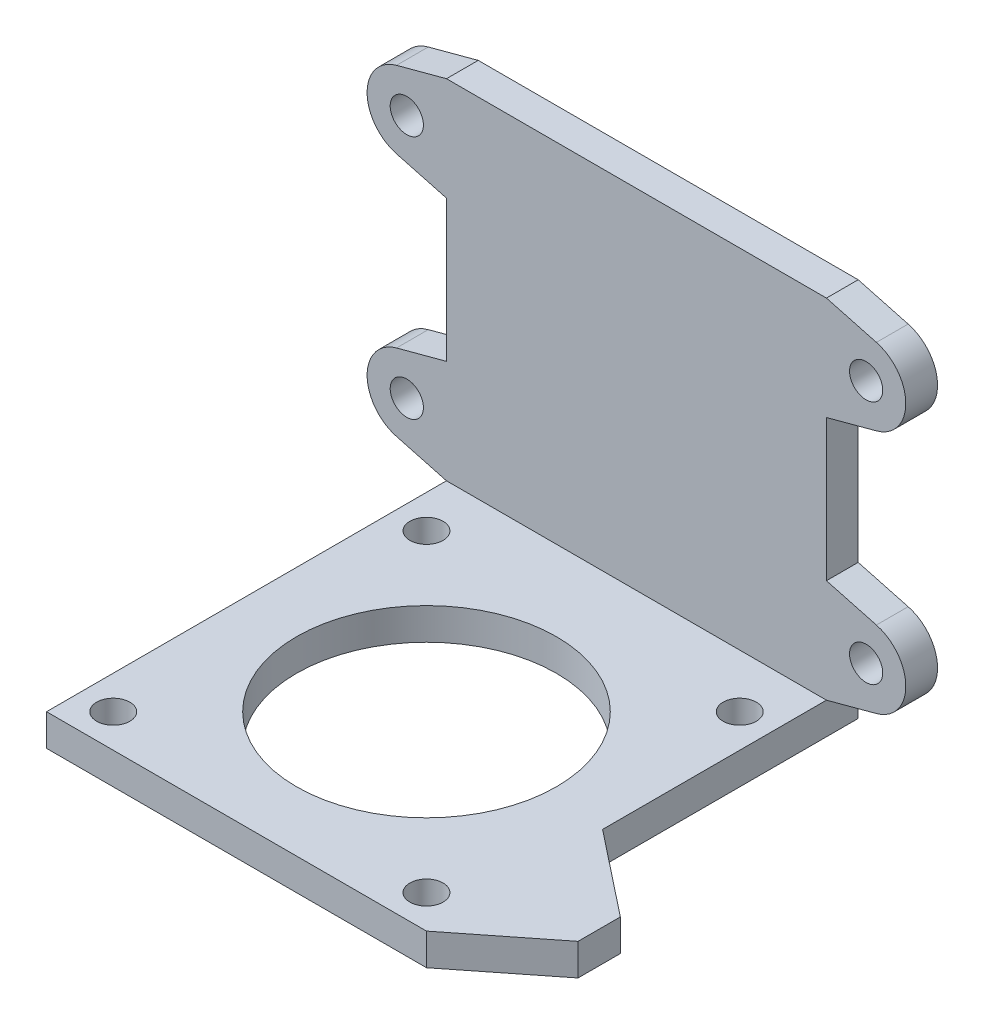
ISO-10303-21;
HEADER;
FILE_DESCRIPTION(('STEP AP214'),'2;1');
FILE_NAME('part.step','',(''),(''),'','','');
FILE_SCHEMA(('AUTOMOTIVE_DESIGN { 1 0 10303 214 1 1 1 1 }'));
ENDSEC;
DATA;
#1=APPLICATION_CONTEXT('core data for automotive mechanical design processes');
#2=APPLICATION_PROTOCOL_DEFINITION('international standard','automotive_design',2000,#1);
#3=PRODUCT_CONTEXT('',#1,'mechanical');
#4=PRODUCT('Part','Part','',(#3));
#5=PRODUCT_RELATED_PRODUCT_CATEGORY('part','',(#4));
#6=PRODUCT_DEFINITION_FORMATION('','',#4);
#7=PRODUCT_DEFINITION_CONTEXT('part definition',#1,'design');
#8=PRODUCT_DEFINITION('design','',#6,#7);
#9=PRODUCT_DEFINITION_SHAPE('','',#8);
#10=(LENGTH_UNIT() NAMED_UNIT(*) SI_UNIT(.MILLI.,.METRE.));
#11=(NAMED_UNIT(*) PLANE_ANGLE_UNIT() SI_UNIT($,.RADIAN.));
#12=(NAMED_UNIT(*) SI_UNIT($,.STERADIAN.) SOLID_ANGLE_UNIT());
#13=UNCERTAINTY_MEASURE_WITH_UNIT(LENGTH_MEASURE(1.E-05),#10,'distance_accuracy_value','');
#14=(GEOMETRIC_REPRESENTATION_CONTEXT(3) GLOBAL_UNCERTAINTY_ASSIGNED_CONTEXT((#13)) GLOBAL_UNIT_ASSIGNED_CONTEXT((#10,
#11,#12)) REPRESENTATION_CONTEXT('',''));
#15=CARTESIAN_POINT('',(0.,0.,0.));
#16=DIRECTION('',(0.,0.,1.));
#17=DIRECTION('',(1.,0.,0.));
#18=AXIS2_PLACEMENT_3D('',#15,#16,#17);
#19=CARTESIAN_POINT('',(-28.5,28.5,4.7625));
#20=DIRECTION('',(1.,0.,0.));
#21=DIRECTION('',(0.,1.,0.));
#22=AXIS2_PLACEMENT_3D('',#19,#20,#21);
#23=PLANE('',#22);
#24=DIRECTION('',(0.,0.,-1.));
#25=VECTOR('',#24,1.);
#26=CARTESIAN_POINT('',(-28.5,-8.22097290460938,4.7625));
#27=LINE('',#26,#25);
#28=CARTESIAN_POINT('',(-28.5,-8.22097290460937,4.7625));
#29=VERTEX_POINT('',#28);
#30=CARTESIAN_POINT('',(-28.5,-8.22097290460937,0.));
#31=VERTEX_POINT('',#30);
#32=EDGE_CURVE('E55',#29,#31,#27,.T.);
#33=ORIENTED_EDGE('',*,*,#32,.F.);
#34=DIRECTION('',(0.,-1.,0.));
#35=VECTOR('',#34,1.);
#36=CARTESIAN_POINT('',(-28.5,28.5,4.7625));
#37=LINE('',#36,#35);
#38=CARTESIAN_POINT('',(-28.5,12.9834729046094,4.7625));
#39=VERTEX_POINT('',#38);
#40=EDGE_CURVE('E240',#39,#29,#37,.T.);
#41=ORIENTED_EDGE('',*,*,#40,.F.);
#42=DIRECTION('',(0.,0.,-1.));
#43=VECTOR('',#42,1.);
#44=CARTESIAN_POINT('',(-28.5,12.9834729046094,4.7625));
#45=LINE('',#44,#43);
#46=CARTESIAN_POINT('',(-28.5,12.9834729046094,0.));
#47=VERTEX_POINT('',#46);
#48=EDGE_CURVE('E324',#39,#47,#45,.T.);
#49=ORIENTED_EDGE('',*,*,#48,.T.);
#50=DIRECTION('',(0.,-1.,0.));
#51=VECTOR('',#50,1.);
#52=CARTESIAN_POINT('',(-28.5,28.5,0.));
#53=LINE('',#52,#51);
#54=EDGE_CURVE('E60',#47,#31,#53,.T.);
#55=ORIENTED_EDGE('',*,*,#54,.T.);
#56=EDGE_LOOP('',(#33,#41,#49,#55));
#57=FACE_BOUND('',#56,.T.);
#58=ADVANCED_FACE('F39',(#57),#23,.F.);
#59=DIRECTION('',(0.,0.,-1.));
#60=VECTOR('',#59,1.);
#61=CARTESIAN_POINT('',(-28.5,-23.7375,4.7625));
#62=LINE('',#61,#60);
#63=CARTESIAN_POINT('',(-28.5,-23.7375,4.7625));
#64=VERTEX_POINT('',#63);
#65=CARTESIAN_POINT('',(-28.5,-23.7375,0.));
#66=VERTEX_POINT('',#65);
#67=EDGE_CURVE('E435',#64,#66,#62,.T.);
#68=ORIENTED_EDGE('',*,*,#67,.T.);
#69=CARTESIAN_POINT('',(-28.5,-28.5,0.));
#70=VERTEX_POINT('',#69);
#71=EDGE_CURVE('E249',#66,#70,#53,.T.);
#72=ORIENTED_EDGE('',*,*,#71,.T.);
#73=DIRECTION('',(0.,0.,-1.));
#74=VECTOR('',#73,1.);
#75=CARTESIAN_POINT('',(-28.5,-28.5,4.7625));
#76=LINE('',#75,#74);
#77=CARTESIAN_POINT('',(-28.5,-28.5,64.7625));
#78=VERTEX_POINT('',#77);
#79=EDGE_CURVE('E257',#78,#70,#76,.T.);
#80=ORIENTED_EDGE('',*,*,#79,.F.);
#81=DIRECTION('',(0.,-1.,0.));
#82=VECTOR('',#81,1.);
#83=CARTESIAN_POINT('',(-28.5,-28.5,64.7625));
#84=LINE('',#83,#82);
#85=CARTESIAN_POINT('',(-28.5,-23.7375,64.7625));
#86=VERTEX_POINT('',#85);
#87=EDGE_CURVE('E412',#86,#78,#84,.T.);
#88=ORIENTED_EDGE('',*,*,#87,.F.);
#89=DIRECTION('',(0.,0.,-1.));
#90=VECTOR('',#89,1.);
#91=CARTESIAN_POINT('',(-28.5,-23.7375,64.7625));
#92=LINE('',#91,#90);
#93=EDGE_CURVE('E220',#86,#64,#92,.T.);
#94=ORIENTED_EDGE('',*,*,#93,.T.);
#95=EDGE_LOOP('',(#68,#72,#80,#88,#94));
#96=FACE_BOUND('',#95,.T.);
#97=ADVANCED_FACE('F433',(#96),#23,.F.);
#98=CARTESIAN_POINT('',(28.5,28.5,4.7625));
#99=DIRECTION('',(-1.,0.,0.));
#100=DIRECTION('',(0.,-1.,0.));
#101=AXIS2_PLACEMENT_3D('',#98,#99,#100);
#102=PLANE('',#101);
#103=DIRECTION('',(0.,0.,-1.));
#104=VECTOR('',#103,1.);
#105=CARTESIAN_POINT('',(28.5,12.9834729046094,4.7625));
#106=LINE('',#105,#104);
#107=CARTESIAN_POINT('',(28.5,12.9834729046094,4.7625));
#108=VERTEX_POINT('',#107);
#109=CARTESIAN_POINT('',(28.5,12.9834729046094,0.));
#110=VERTEX_POINT('',#109);
#111=EDGE_CURVE('E281',#108,#110,#106,.T.);
#112=ORIENTED_EDGE('',*,*,#111,.F.);
#113=DIRECTION('',(0.,1.,0.));
#114=VECTOR('',#113,1.);
#115=CARTESIAN_POINT('',(28.5,28.5,4.7625));
#116=LINE('',#115,#114);
#117=CARTESIAN_POINT('',(28.5,-8.22097290460938,4.7625));
#118=VERTEX_POINT('',#117);
#119=EDGE_CURVE('E231',#118,#108,#116,.T.);
#120=ORIENTED_EDGE('',*,*,#119,.F.);
#121=DIRECTION('',(0.,0.,-1.));
#122=VECTOR('',#121,1.);
#123=CARTESIAN_POINT('',(28.5,-8.22097290460938,4.7625));
#124=LINE('',#123,#122);
#125=CARTESIAN_POINT('',(28.5,-8.22097290460937,0.));
#126=VERTEX_POINT('',#125);
#127=EDGE_CURVE('E350',#118,#126,#124,.T.);
#128=ORIENTED_EDGE('',*,*,#127,.T.);
#129=DIRECTION('',(0.,1.,0.));
#130=VECTOR('',#129,1.);
#131=CARTESIAN_POINT('',(28.5,28.5,0.));
#132=LINE('',#131,#130);
#133=EDGE_CURVE('E219',#126,#110,#132,.T.);
#134=ORIENTED_EDGE('',*,*,#133,.T.);
#135=EDGE_LOOP('',(#112,#120,#128,#134));
#136=FACE_BOUND('',#135,.T.);
#137=ADVANCED_FACE('F41',(#136),#102,.F.);
#138=DIRECTION('',(0.,0.,-1.));
#139=VECTOR('',#138,1.);
#140=CARTESIAN_POINT('',(28.5,-23.7375,64.7625));
#141=LINE('',#140,#139);
#142=CARTESIAN_POINT('',(28.5,-23.7375,38.3465000000001));
#143=VERTEX_POINT('',#142);
#144=CARTESIAN_POINT('',(28.5,-23.7375,4.7625));
#145=VERTEX_POINT('',#144);
#146=EDGE_CURVE('E205',#143,#145,#141,.T.);
#147=ORIENTED_EDGE('',*,*,#146,.F.);
#148=DIRECTION('',(0.,-1.,0.));
#149=VECTOR('',#148,1.);
#150=CARTESIAN_POINT('',(28.5,-23.7375,38.3465000000001));
#151=LINE('',#150,#149);
#152=CARTESIAN_POINT('',(28.5,-28.5,38.3465000000001));
#153=VERTEX_POINT('',#152);
#154=EDGE_CURVE('E189',#143,#153,#151,.T.);
#155=ORIENTED_EDGE('',*,*,#154,.T.);
#156=DIRECTION('',(0.,0.,-1.));
#157=VECTOR('',#156,1.);
#158=CARTESIAN_POINT('',(28.5,-28.5,4.7625));
#159=LINE('',#158,#157);
#160=CARTESIAN_POINT('',(28.5,-28.5,0.));
#161=VERTEX_POINT('',#160);
#162=EDGE_CURVE('E242',#153,#161,#159,.T.);
#163=ORIENTED_EDGE('',*,*,#162,.T.);
#164=CARTESIAN_POINT('',(28.5,-23.7375,0.));
#165=VERTEX_POINT('',#164);
#166=EDGE_CURVE('E224',#161,#165,#132,.T.);
#167=ORIENTED_EDGE('',*,*,#166,.T.);
#168=DIRECTION('',(0.,0.,-1.));
#169=VECTOR('',#168,1.);
#170=CARTESIAN_POINT('',(28.5,-23.7375,4.7625));
#171=LINE('',#170,#169);
#172=EDGE_CURVE('E216',#145,#165,#171,.T.);
#173=ORIENTED_EDGE('',*,*,#172,.F.);
#174=EDGE_LOOP('',(#147,#155,#163,#167,#173));
#175=FACE_BOUND('',#174,.T.);
#176=ADVANCED_FACE('F213',(#175),#102,.F.);
#177=CARTESIAN_POINT('',(-28.5,-28.5,4.7625));
#178=DIRECTION('',(0.,1.,0.));
#179=DIRECTION('',(0.,0.,1.));
#180=AXIS2_PLACEMENT_3D('',#177,#178,#179);
#181=PLANE('',#180);
#182=CARTESIAN_POINT('',(23.495,-28.5,12.7675));
#183=DIRECTION('',(0.,-1.,0.));
#184=DIRECTION('',(0.,0.,-1.));
#185=AXIS2_PLACEMENT_3D('',#182,#183,#184);
#186=CIRCLE('',#185,2.48919999999999);
#187=CARTESIAN_POINT('',(23.495,-28.5,10.2783));
#188=VERTEX_POINT('',#187);
#189=EDGE_CURVE('E371',#188,#188,#186,.T.);
#190=ORIENTED_EDGE('',*,*,#189,.F.);
#191=EDGE_LOOP('',(#190));
#192=FACE_BOUND('',#191,.T.);
#193=CARTESIAN_POINT('',(-23.495,-28.5,59.7575));
#194=DIRECTION('',(0.,-1.,0.));
#195=DIRECTION('',(0.,0.,-1.));
#196=AXIS2_PLACEMENT_3D('',#193,#194,#195);
#197=CIRCLE('',#196,2.48919999999999);
#198=CARTESIAN_POINT('',(-23.495,-28.5,57.2683));
#199=VERTEX_POINT('',#198);
#200=EDGE_CURVE('E379',#199,#199,#197,.T.);
#201=ORIENTED_EDGE('',*,*,#200,.F.);
#202=EDGE_LOOP('',(#201));
#203=FACE_BOUND('',#202,.T.);
#204=CARTESIAN_POINT('',(-23.495,-28.5,12.7675));
#205=DIRECTION('',(0.,-1.,0.));
#206=DIRECTION('',(0.,0.,-1.));
#207=AXIS2_PLACEMENT_3D('',#204,#205,#206);
#208=CIRCLE('',#207,2.48919999999999);
#209=CARTESIAN_POINT('',(-23.495,-28.5,10.2783));
#210=VERTEX_POINT('',#209);
#211=EDGE_CURVE('E387',#210,#210,#208,.T.);
#212=ORIENTED_EDGE('',*,*,#211,.F.);
#213=EDGE_LOOP('',(#212));
#214=FACE_BOUND('',#213,.T.);
#215=CARTESIAN_POINT('',(0.,-28.5,36.2625));
#216=DIRECTION('',(0.,1.,0.));
#217=DIRECTION('',(0.,0.,1.));
#218=AXIS2_PLACEMENT_3D('',#215,#216,#217);
#219=CIRCLE('',#218,19.5);
#220=CARTESIAN_POINT('',(0.,-28.5,55.7625));
#221=VERTEX_POINT('',#220);
#222=EDGE_CURVE('E404',#221,#221,#219,.T.);
#223=ORIENTED_EDGE('',*,*,#222,.T.);
#224=EDGE_LOOP('',(#223));
#225=FACE_BOUND('',#224,.T.);
#226=DIRECTION('',(1.,0.,0.));
#227=VECTOR('',#226,1.);
#228=CARTESIAN_POINT('',(-28.5,-28.5,0.));
#229=LINE('',#228,#227);
#230=EDGE_CURVE('E236',#70,#161,#229,.T.);
#231=ORIENTED_EDGE('',*,*,#230,.T.);
#232=ORIENTED_EDGE('',*,*,#162,.F.);
#233=DIRECTION('',(0.784681867165343,0.,0.619898675060618));
#234=VECTOR('',#233,1.);
#235=CARTESIAN_POINT('',(41.2,-28.5,48.3795));
#236=LINE('',#235,#234);
#237=CARTESIAN_POINT('',(41.2,-28.5,48.3795));
#238=VERTEX_POINT('',#237);
#239=EDGE_CURVE('E195',#153,#238,#236,.T.);
#240=ORIENTED_EDGE('',*,*,#239,.T.);
#241=DIRECTION('',(0.,0.,1.));
#242=VECTOR('',#241,1.);
#243=CARTESIAN_POINT('',(41.2,-28.5,48.3795));
#244=LINE('',#243,#242);
#245=CARTESIAN_POINT('',(41.2,-28.5,54.7295));
#246=VERTEX_POINT('',#245);
#247=EDGE_CURVE('E550',#238,#246,#244,.T.);
#248=ORIENTED_EDGE('',*,*,#247,.T.);
#249=DIRECTION('',(-0.784681867165342,0.,0.61989867506062));
#250=VECTOR('',#249,1.);
#251=CARTESIAN_POINT('',(41.2,-28.5,54.7295));
#252=LINE('',#251,#250);
#253=CARTESIAN_POINT('',(28.5,-28.5,64.7625));
#254=VERTEX_POINT('',#253);
#255=EDGE_CURVE('E556',#246,#254,#252,.T.);
#256=ORIENTED_EDGE('',*,*,#255,.T.);
#257=DIRECTION('',(1.,0.,0.));
#258=VECTOR('',#257,1.);
#259=CARTESIAN_POINT('',(-28.5,-28.5,64.7625));
#260=LINE('',#259,#258);
#261=EDGE_CURVE('E416',#78,#254,#260,.T.);
#262=ORIENTED_EDGE('',*,*,#261,.F.);
#263=ORIENTED_EDGE('',*,*,#79,.T.);
#264=EDGE_LOOP('',(#231,#232,#240,#248,#256,#262,#263));
#265=FACE_BOUND('',#264,.T.);
#266=CARTESIAN_POINT('',(23.495,-28.5,59.7575));
#267=DIRECTION('',(0.,-1.,0.));
#268=DIRECTION('',(0.,0.,-1.));
#269=AXIS2_PLACEMENT_3D('',#266,#267,#268);
#270=CIRCLE('',#269,2.48919999999999);
#271=CARTESIAN_POINT('',(23.495,-28.5,57.2683));
#272=VERTEX_POINT('',#271);
#273=EDGE_CURVE('E395',#272,#272,#270,.T.);
#274=ORIENTED_EDGE('',*,*,#273,.F.);
#275=EDGE_LOOP('',(#274));
#276=FACE_BOUND('',#275,.T.);
#277=ADVANCED_FACE('F494',(#192,#203,#214,#225,#265,#276),#181,.F.);
#278=CARTESIAN_POINT('',(-28.5,28.5,4.7625));
#279=DIRECTION('',(0.,-1.,0.));
#280=DIRECTION('',(0.,0.,-1.));
#281=AXIS2_PLACEMENT_3D('',#278,#279,#280);
#282=PLANE('',#281);
#283=DIRECTION('',(-1.,0.,0.));
#284=VECTOR('',#283,1.);
#285=CARTESIAN_POINT('',(-28.5,28.5,0.));
#286=LINE('',#285,#284);
#287=CARTESIAN_POINT('',(28.5,28.5,0.));
#288=VERTEX_POINT('',#287);
#289=CARTESIAN_POINT('',(-28.5,28.5,0.));
#290=VERTEX_POINT('',#289);
#291=EDGE_CURVE('E245',#288,#290,#286,.T.);
#292=ORIENTED_EDGE('',*,*,#291,.T.);
#293=DIRECTION('',(0.,0.,-1.));
#294=VECTOR('',#293,1.);
#295=CARTESIAN_POINT('',(-28.5,28.5,4.7625));
#296=LINE('',#295,#294);
#297=CARTESIAN_POINT('',(-28.5,28.5,4.7625));
#298=VERTEX_POINT('',#297);
#299=EDGE_CURVE('E48',#298,#290,#296,.T.);
#300=ORIENTED_EDGE('',*,*,#299,.F.);
#301=DIRECTION('',(-1.,0.,0.));
#302=VECTOR('',#301,1.);
#303=CARTESIAN_POINT('',(-28.5,28.5,4.7625));
#304=LINE('',#303,#302);
#305=CARTESIAN_POINT('',(28.5,28.5,4.7625));
#306=VERTEX_POINT('',#305);
#307=EDGE_CURVE('E235',#306,#298,#304,.T.);
#308=ORIENTED_EDGE('',*,*,#307,.F.);
#309=DIRECTION('',(0.,0.,-1.));
#310=VECTOR('',#309,1.);
#311=CARTESIAN_POINT('',(28.5,28.5,4.7625));
#312=LINE('',#311,#310);
#313=EDGE_CURVE('E11',#306,#288,#312,.T.);
#314=ORIENTED_EDGE('',*,*,#313,.T.);
#315=EDGE_LOOP('',(#292,#300,#308,#314));
#316=FACE_BOUND('',#315,.T.);
#317=ADVANCED_FACE('F283',(#316),#282,.F.);
#318=CARTESIAN_POINT('',(0.,0.,4.7625));
#319=DIRECTION('',(0.,0.,1.));
#320=DIRECTION('',(1.,0.,0.));
#321=AXIS2_PLACEMENT_3D('',#318,#319,#320);
#322=PLANE('',#321);
#323=CARTESIAN_POINT('',(34.453125,-15.9792364523047,4.7625));
#324=DIRECTION('',(0.,0.,1.));
#325=DIRECTION('',(1.,0.,0.));
#326=AXIS2_PLACEMENT_3D('',#323,#324,#325);
#327=CIRCLE('',#326,2.4892);
#328=CARTESIAN_POINT('',(36.942325,-15.9792364523047,4.7625));
#329=VERTEX_POINT('',#328);
#330=EDGE_CURVE('E541',#329,#329,#327,.T.);
#331=ORIENTED_EDGE('',*,*,#330,.F.);
#332=EDGE_LOOP('',(#331));
#333=FACE_BOUND('',#332,.T.);
#334=CARTESIAN_POINT('',(34.453125,20.7417364523047,4.7625));
#335=DIRECTION('',(0.,0.,1.));
#336=DIRECTION('',(1.,0.,0.));
#337=AXIS2_PLACEMENT_3D('',#334,#335,#336);
#338=CIRCLE('',#337,2.4892);
#339=CARTESIAN_POINT('',(36.942325,20.7417364523047,4.7625));
#340=VERTEX_POINT('',#339);
#341=EDGE_CURVE('E533',#340,#340,#338,.T.);
#342=ORIENTED_EDGE('',*,*,#341,.F.);
#343=EDGE_LOOP('',(#342));
#344=FACE_BOUND('',#343,.T.);
#345=CARTESIAN_POINT('',(-34.453125,20.7417364523047,4.7625));
#346=DIRECTION('',(0.,0.,1.));
#347=DIRECTION('',(1.,0.,0.));
#348=AXIS2_PLACEMENT_3D('',#345,#346,#347);
#349=CIRCLE('',#348,2.4892);
#350=CARTESIAN_POINT('',(-31.963925,20.7417364523047,4.7625));
#351=VERTEX_POINT('',#350);
#352=EDGE_CURVE('E525',#351,#351,#349,.T.);
#353=ORIENTED_EDGE('',*,*,#352,.F.);
#354=EDGE_LOOP('',(#353));
#355=FACE_BOUND('',#354,.T.);
#356=CARTESIAN_POINT('',(-34.453125,-15.9792364523047,4.7625));
#357=DIRECTION('',(0.,0.,1.));
#358=DIRECTION('',(1.,0.,0.));
#359=AXIS2_PLACEMENT_3D('',#356,#357,#358);
#360=CIRCLE('',#359,2.4892);
#361=CARTESIAN_POINT('',(-31.963925,-15.9792364523047,4.7625));
#362=VERTEX_POINT('',#361);
#363=EDGE_CURVE('E517',#362,#362,#360,.T.);
#364=ORIENTED_EDGE('',*,*,#363,.F.);
#365=EDGE_LOOP('',(#364));
#366=FACE_BOUND('',#365,.T.);
#367=DIRECTION('',(-1.,0.,0.));
#368=VECTOR('',#367,1.);
#369=CARTESIAN_POINT('',(-28.5,-23.7375,4.7625));
#370=LINE('',#369,#368);
#371=EDGE_CURVE('E408',#145,#64,#370,.T.);
#372=ORIENTED_EDGE('',*,*,#371,.F.);
#373=DIRECTION('',(0.965925826289069,0.258819045102518,0.));
#374=VECTOR('',#373,1.);
#375=CARTESIAN_POINT('',(28.5,-23.7375,4.7625));
#376=LINE('',#375,#374);
#377=CARTESIAN_POINT('',(35.9939071278759,-21.7295136369318,4.7625));
#378=VERTEX_POINT('',#377);
#379=EDGE_CURVE('E340',#145,#378,#376,.T.);
#380=ORIENTED_EDGE('',*,*,#379,.T.);
#381=CARTESIAN_POINT('',(34.453125,-15.9792364523047,4.7625));
#382=DIRECTION('',(0.,0.,1.));
#383=DIRECTION('',(1.,0.,0.));
#384=AXIS2_PLACEMENT_3D('',#381,#382,#383);
#385=CIRCLE('',#384,5.953125);
#386=CARTESIAN_POINT('',(35.993907127876,-10.2289592676776,4.7625));
#387=VERTEX_POINT('',#386);
#388=EDGE_CURVE('E343',#378,#387,#385,.T.);
#389=ORIENTED_EDGE('',*,*,#388,.T.);
#390=DIRECTION('',(-0.965925826289067,0.258819045102525,0.));
#391=VECTOR('',#390,1.);
#392=CARTESIAN_POINT('',(28.5,-8.22097290460938,4.7625));
#393=LINE('',#392,#391);
#394=EDGE_CURVE('E347',#387,#118,#393,.T.);
#395=ORIENTED_EDGE('',*,*,#394,.T.);
#396=ORIENTED_EDGE('',*,*,#119,.T.);
#397=DIRECTION('',(0.965925826289067,0.258819045102525,0.));
#398=VECTOR('',#397,1.);
#399=CARTESIAN_POINT('',(28.5,12.9834729046094,4.7625));
#400=LINE('',#399,#398);
#401=CARTESIAN_POINT('',(35.993907127876,14.9914592676776,4.7625));
#402=VERTEX_POINT('',#401);
#403=EDGE_CURVE('E296',#108,#402,#400,.T.);
#404=ORIENTED_EDGE('',*,*,#403,.T.);
#405=CARTESIAN_POINT('',(34.453125,20.7417364523047,4.7625));
#406=DIRECTION('',(0.,0.,1.));
#407=DIRECTION('',(-1.,0.,0.));
#408=AXIS2_PLACEMENT_3D('',#405,#406,#407);
#409=CIRCLE('',#408,5.953125);
#410=CARTESIAN_POINT('',(35.9939071278759,26.4920136369318,4.7625));
#411=VERTEX_POINT('',#410);
#412=EDGE_CURVE('E301',#402,#411,#409,.T.);
#413=ORIENTED_EDGE('',*,*,#412,.T.);
#414=DIRECTION('',(-0.965925826289069,0.258819045102518,0.));
#415=VECTOR('',#414,1.);
#416=CARTESIAN_POINT('',(28.5,28.5,4.7625));
#417=LINE('',#416,#415);
#418=EDGE_CURVE('E290',#411,#306,#417,.T.);
#419=ORIENTED_EDGE('',*,*,#418,.T.);
#420=ORIENTED_EDGE('',*,*,#307,.T.);
#421=DIRECTION('',(-0.965925826289069,-0.258819045102517,0.));
#422=VECTOR('',#421,1.);
#423=CARTESIAN_POINT('',(-28.5,28.5,4.7625));
#424=LINE('',#423,#422);
#425=CARTESIAN_POINT('',(-35.9939071278759,26.4920136369318,4.7625));
#426=VERTEX_POINT('',#425);
#427=EDGE_CURVE('E269',#298,#426,#424,.T.);
#428=ORIENTED_EDGE('',*,*,#427,.T.);
#429=CARTESIAN_POINT('',(-34.453125,20.7417364523047,4.7625));
#430=DIRECTION('',(0.,0.,1.));
#431=DIRECTION('',(1.,0.,0.));
#432=AXIS2_PLACEMENT_3D('',#429,#430,#431);
#433=CIRCLE('',#432,5.953125);
#434=CARTESIAN_POINT('',(-35.993907127876,14.9914592676776,4.7625));
#435=VERTEX_POINT('',#434);
#436=EDGE_CURVE('E318',#426,#435,#433,.T.);
#437=ORIENTED_EDGE('',*,*,#436,.T.);
#438=DIRECTION('',(0.965925826289067,-0.258819045102525,0.));
#439=VECTOR('',#438,1.);
#440=CARTESIAN_POINT('',(-28.5,12.9834729046094,4.7625));
#441=LINE('',#440,#439);
#442=EDGE_CURVE('E322',#435,#39,#441,.T.);
#443=ORIENTED_EDGE('',*,*,#442,.T.);
#444=ORIENTED_EDGE('',*,*,#40,.T.);
#445=DIRECTION('',(-0.965925826289067,-0.258819045102525,0.));
#446=VECTOR('',#445,1.);
#447=CARTESIAN_POINT('',(-28.5,-8.22097290460938,4.7625));
#448=LINE('',#447,#446);
#449=CARTESIAN_POINT('',(-35.993907127876,-10.2289592676776,4.7625));
#450=VERTEX_POINT('',#449);
#451=EDGE_CURVE('E502',#29,#450,#448,.T.);
#452=ORIENTED_EDGE('',*,*,#451,.T.);
#453=CARTESIAN_POINT('',(-34.453125,-15.9792364523047,4.7625));
#454=DIRECTION('',(0.,0.,1.));
#455=DIRECTION('',(-1.,0.,0.));
#456=AXIS2_PLACEMENT_3D('',#453,#454,#455);
#457=CIRCLE('',#456,5.953125);
#458=CARTESIAN_POINT('',(-35.9939071278759,-21.7295136369318,4.7625));
#459=VERTEX_POINT('',#458);
#460=EDGE_CURVE('E441',#450,#459,#457,.T.);
#461=ORIENTED_EDGE('',*,*,#460,.T.);
#462=DIRECTION('',(0.965925826289069,-0.258819045102518,0.));
#463=VECTOR('',#462,1.);
#464=CARTESIAN_POINT('',(-28.5,-23.7375,4.7625));
#465=LINE('',#464,#463);
#466=EDGE_CURVE('E438',#459,#64,#465,.T.);
#467=ORIENTED_EDGE('',*,*,#466,.T.);
#468=EDGE_LOOP('',(#372,#380,#389,#395,#396,#404,#413,#419,#420,#428,#437,#443,#444,#452,#461,#467));
#469=FACE_BOUND('',#468,.T.);
#470=ADVANCED_FACE('F439',(#333,#344,#355,#366,#469),#322,.T.);
#471=CARTESIAN_POINT('',(0.,0.,0.));
#472=DIRECTION('',(0.,0.,1.));
#473=DIRECTION('',(1.,0.,0.));
#474=AXIS2_PLACEMENT_3D('',#471,#472,#473);
#475=PLANE('',#474);
#476=CARTESIAN_POINT('',(34.453125,-15.9792364523047,0.));
#477=DIRECTION('',(0.,0.,1.));
#478=DIRECTION('',(1.,0.,0.));
#479=AXIS2_PLACEMENT_3D('',#476,#477,#478);
#480=CIRCLE('',#479,2.4892);
#481=CARTESIAN_POINT('',(36.942325,-15.9792364523047,0.));
#482=VERTEX_POINT('',#481);
#483=EDGE_CURVE('E537',#482,#482,#480,.T.);
#484=ORIENTED_EDGE('',*,*,#483,.T.);
#485=EDGE_LOOP('',(#484));
#486=FACE_BOUND('',#485,.T.);
#487=CARTESIAN_POINT('',(34.453125,20.7417364523047,0.));
#488=DIRECTION('',(0.,0.,1.));
#489=DIRECTION('',(1.,0.,0.));
#490=AXIS2_PLACEMENT_3D('',#487,#488,#489);
#491=CIRCLE('',#490,2.4892);
#492=CARTESIAN_POINT('',(36.942325,20.7417364523047,0.));
#493=VERTEX_POINT('',#492);
#494=EDGE_CURVE('E529',#493,#493,#491,.T.);
#495=ORIENTED_EDGE('',*,*,#494,.T.);
#496=EDGE_LOOP('',(#495));
#497=FACE_BOUND('',#496,.T.);
#498=CARTESIAN_POINT('',(-34.453125,20.7417364523047,0.));
#499=DIRECTION('',(0.,0.,1.));
#500=DIRECTION('',(1.,0.,0.));
#501=AXIS2_PLACEMENT_3D('',#498,#499,#500);
#502=CIRCLE('',#501,2.4892);
#503=CARTESIAN_POINT('',(-31.963925,20.7417364523047,0.));
#504=VERTEX_POINT('',#503);
#505=EDGE_CURVE('E521',#504,#504,#502,.T.);
#506=ORIENTED_EDGE('',*,*,#505,.T.);
#507=EDGE_LOOP('',(#506));
#508=FACE_BOUND('',#507,.T.);
#509=CARTESIAN_POINT('',(-34.453125,-15.9792364523047,0.));
#510=DIRECTION('',(0.,0.,1.));
#511=DIRECTION('',(1.,0.,0.));
#512=AXIS2_PLACEMENT_3D('',#509,#510,#511);
#513=CIRCLE('',#512,2.4892);
#514=CARTESIAN_POINT('',(-31.963925,-15.9792364523047,0.));
#515=VERTEX_POINT('',#514);
#516=EDGE_CURVE('E509',#515,#515,#513,.T.);
#517=ORIENTED_EDGE('',*,*,#516,.T.);
#518=EDGE_LOOP('',(#517));
#519=FACE_BOUND('',#518,.T.);
#520=ORIENTED_EDGE('',*,*,#166,.F.);
#521=ORIENTED_EDGE('',*,*,#230,.F.);
#522=ORIENTED_EDGE('',*,*,#71,.F.);
#523=DIRECTION('',(0.965925826289069,-0.258819045102518,0.));
#524=VECTOR('',#523,1.);
#525=CARTESIAN_POINT('',(-28.5,-23.7375,0.));
#526=LINE('',#525,#524);
#527=CARTESIAN_POINT('',(-35.9939071278759,-21.7295136369318,0.));
#528=VERTEX_POINT('',#527);
#529=EDGE_CURVE('E449',#528,#66,#526,.T.);
#530=ORIENTED_EDGE('',*,*,#529,.F.);
#531=CARTESIAN_POINT('',(-34.453125,-15.9792364523047,0.));
#532=DIRECTION('',(0.,0.,1.));
#533=DIRECTION('',(-1.,0.,0.));
#534=AXIS2_PLACEMENT_3D('',#531,#532,#533);
#535=CIRCLE('',#534,5.953125);
#536=CARTESIAN_POINT('',(-35.993907127876,-10.2289592676776,0.));
#537=VERTEX_POINT('',#536);
#538=EDGE_CURVE('E500',#537,#528,#535,.T.);
#539=ORIENTED_EDGE('',*,*,#538,.F.);
#540=DIRECTION('',(-0.965925826289067,-0.258819045102525,0.));
#541=VECTOR('',#540,1.);
#542=CARTESIAN_POINT('',(-28.5,-8.22097290460938,0.));
#543=LINE('',#542,#541);
#544=EDGE_CURVE('E506',#31,#537,#543,.T.);
#545=ORIENTED_EDGE('',*,*,#544,.F.);
#546=ORIENTED_EDGE('',*,*,#54,.F.);
#547=DIRECTION('',(0.965925826289067,-0.258819045102525,0.));
#548=VECTOR('',#547,1.);
#549=CARTESIAN_POINT('',(-28.5,12.9834729046094,0.));
#550=LINE('',#549,#548);
#551=CARTESIAN_POINT('',(-35.993907127876,14.9914592676776,0.));
#552=VERTEX_POINT('',#551);
#553=EDGE_CURVE('E319',#552,#47,#550,.T.);
#554=ORIENTED_EDGE('',*,*,#553,.F.);
#555=CARTESIAN_POINT('',(-34.453125,20.7417364523047,0.));
#556=DIRECTION('',(0.,0.,1.));
#557=DIRECTION('',(1.,0.,0.));
#558=AXIS2_PLACEMENT_3D('',#555,#556,#557);
#559=CIRCLE('',#558,5.953125);
#560=CARTESIAN_POINT('',(-35.9939071278759,26.4920136369318,0.));
#561=VERTEX_POINT('',#560);
#562=EDGE_CURVE('E278',#561,#552,#559,.T.);
#563=ORIENTED_EDGE('',*,*,#562,.F.);
#564=DIRECTION('',(-0.965925826289069,-0.258819045102517,0.));
#565=VECTOR('',#564,1.);
#566=CARTESIAN_POINT('',(-28.5,28.5,0.));
#567=LINE('',#566,#565);
#568=EDGE_CURVE('E267',#290,#561,#567,.T.);
#569=ORIENTED_EDGE('',*,*,#568,.F.);
#570=ORIENTED_EDGE('',*,*,#291,.F.);
#571=DIRECTION('',(-0.965925826289069,0.258819045102518,0.));
#572=VECTOR('',#571,1.);
#573=CARTESIAN_POINT('',(28.5,28.5,0.));
#574=LINE('',#573,#572);
#575=CARTESIAN_POINT('',(35.9939071278759,26.4920136369318,0.));
#576=VERTEX_POINT('',#575);
#577=EDGE_CURVE('E291',#576,#288,#574,.T.);
#578=ORIENTED_EDGE('',*,*,#577,.F.);
#579=CARTESIAN_POINT('',(34.453125,20.7417364523047,0.));
#580=DIRECTION('',(0.,0.,1.));
#581=DIRECTION('',(-1.,0.,0.));
#582=AXIS2_PLACEMENT_3D('',#579,#580,#581);
#583=CIRCLE('',#582,5.953125);
#584=CARTESIAN_POINT('',(35.993907127876,14.9914592676776,0.));
#585=VERTEX_POINT('',#584);
#586=EDGE_CURVE('E297',#585,#576,#583,.T.);
#587=ORIENTED_EDGE('',*,*,#586,.F.);
#588=DIRECTION('',(0.965925826289067,0.258819045102525,0.));
#589=VECTOR('',#588,1.);
#590=CARTESIAN_POINT('',(28.5,12.9834729046094,0.));
#591=LINE('',#590,#589);
#592=EDGE_CURVE('E303',#110,#585,#591,.T.);
#593=ORIENTED_EDGE('',*,*,#592,.F.);
#594=ORIENTED_EDGE('',*,*,#133,.F.);
#595=DIRECTION('',(-0.965925826289067,0.258819045102525,0.));
#596=VECTOR('',#595,1.);
#597=CARTESIAN_POINT('',(28.5,-8.22097290460938,0.));
#598=LINE('',#597,#596);
#599=CARTESIAN_POINT('',(35.993907127876,-10.2289592676776,0.));
#600=VERTEX_POINT('',#599);
#601=EDGE_CURVE('E344',#600,#126,#598,.T.);
#602=ORIENTED_EDGE('',*,*,#601,.F.);
#603=CARTESIAN_POINT('',(34.453125,-15.9792364523047,0.));
#604=DIRECTION('',(0.,0.,1.));
#605=DIRECTION('',(1.,0.,0.));
#606=AXIS2_PLACEMENT_3D('',#603,#604,#605);
#607=CIRCLE('',#606,5.953125);
#608=CARTESIAN_POINT('',(35.9939071278759,-21.7295136369318,0.));
#609=VERTEX_POINT('',#608);
#610=EDGE_CURVE('E353',#609,#600,#607,.T.);
#611=ORIENTED_EDGE('',*,*,#610,.F.);
#612=DIRECTION('',(0.965925826289069,0.258819045102518,0.));
#613=VECTOR('',#612,1.);
#614=CARTESIAN_POINT('',(28.5,-23.7375,0.));
#615=LINE('',#614,#613);
#616=EDGE_CURVE('E339',#165,#609,#615,.T.);
#617=ORIENTED_EDGE('',*,*,#616,.F.);
#618=EDGE_LOOP('',(#520,#521,#522,#530,#539,#545,#546,#554,#563,#569,#570,#578,#587,#593,#594,
#602,#611,#617));
#619=FACE_BOUND('',#618,.T.);
#620=ADVANCED_FACE('F274',(#486,#497,#508,#519,#619),#475,.F.);
#621=CARTESIAN_POINT('',(-28.5,-23.7375,64.7625));
#622=DIRECTION('',(0.,-1.,0.));
#623=DIRECTION('',(0.,0.,-1.));
#624=AXIS2_PLACEMENT_3D('',#621,#622,#623);
#625=PLANE('',#624);
#626=CARTESIAN_POINT('',(23.495,-23.7375,12.7675));
#627=DIRECTION('',(0.,-1.,0.));
#628=DIRECTION('',(0.,0.,-1.));
#629=AXIS2_PLACEMENT_3D('',#626,#627,#628);
#630=CIRCLE('',#629,2.48919999999999);
#631=CARTESIAN_POINT('',(23.495,-23.7375,10.2783));
#632=VERTEX_POINT('',#631);
#633=EDGE_CURVE('E375',#632,#632,#630,.T.);
#634=ORIENTED_EDGE('',*,*,#633,.T.);
#635=EDGE_LOOP('',(#634));
#636=FACE_BOUND('',#635,.T.);
#637=CARTESIAN_POINT('',(-23.495,-23.7375,59.7575));
#638=DIRECTION('',(0.,-1.,0.));
#639=DIRECTION('',(0.,0.,-1.));
#640=AXIS2_PLACEMENT_3D('',#637,#638,#639);
#641=CIRCLE('',#640,2.48919999999999);
#642=CARTESIAN_POINT('',(-23.495,-23.7375,57.2683));
#643=VERTEX_POINT('',#642);
#644=EDGE_CURVE('E383',#643,#643,#641,.T.);
#645=ORIENTED_EDGE('',*,*,#644,.T.);
#646=EDGE_LOOP('',(#645));
#647=FACE_BOUND('',#646,.T.);
#648=CARTESIAN_POINT('',(-23.495,-23.7375,12.7675));
#649=DIRECTION('',(0.,-1.,0.));
#650=DIRECTION('',(0.,0.,-1.));
#651=AXIS2_PLACEMENT_3D('',#648,#649,#650);
#652=CIRCLE('',#651,2.48919999999999);
#653=CARTESIAN_POINT('',(-23.495,-23.7375,10.2783));
#654=VERTEX_POINT('',#653);
#655=EDGE_CURVE('E391',#654,#654,#652,.T.);
#656=ORIENTED_EDGE('',*,*,#655,.T.);
#657=EDGE_LOOP('',(#656));
#658=FACE_BOUND('',#657,.T.);
#659=CARTESIAN_POINT('',(23.495,-23.7375,59.7575));
#660=DIRECTION('',(0.,-1.,0.));
#661=DIRECTION('',(0.,0.,-1.));
#662=AXIS2_PLACEMENT_3D('',#659,#660,#661);
#663=CIRCLE('',#662,2.48919999999999);
#664=CARTESIAN_POINT('',(23.495,-23.7375,57.2683));
#665=VERTEX_POINT('',#664);
#666=EDGE_CURVE('E399',#665,#665,#663,.T.);
#667=ORIENTED_EDGE('',*,*,#666,.T.);
#668=EDGE_LOOP('',(#667));
#669=FACE_BOUND('',#668,.T.);
#670=CARTESIAN_POINT('',(0.,-23.7375,36.2625));
#671=DIRECTION('',(0.,1.,0.));
#672=DIRECTION('',(0.,0.,1.));
#673=AXIS2_PLACEMENT_3D('',#670,#671,#672);
#674=CIRCLE('',#673,19.5);
#675=CARTESIAN_POINT('',(0.,-23.7375,55.7625));
#676=VERTEX_POINT('',#675);
#677=EDGE_CURVE('E403',#676,#676,#674,.T.);
#678=ORIENTED_EDGE('',*,*,#677,.F.);
#679=EDGE_LOOP('',(#678));
#680=FACE_BOUND('',#679,.T.);
#681=ORIENTED_EDGE('',*,*,#371,.T.);
#682=ORIENTED_EDGE('',*,*,#93,.F.);
#683=DIRECTION('',(-1.,0.,0.));
#684=VECTOR('',#683,1.);
#685=CARTESIAN_POINT('',(-28.5,-23.7375,64.7625));
#686=LINE('',#685,#684);
#687=CARTESIAN_POINT('',(28.5,-23.7375,64.7625));
#688=VERTEX_POINT('',#687);
#689=EDGE_CURVE('E227',#688,#86,#686,.T.);
#690=ORIENTED_EDGE('',*,*,#689,.F.);
#691=DIRECTION('',(-0.784681867165342,0.,0.61989867506062));
#692=VECTOR('',#691,1.);
#693=CARTESIAN_POINT('',(41.2,-23.7375,54.7295));
#694=LINE('',#693,#692);
#695=CARTESIAN_POINT('',(41.2,-23.7375,54.7295));
#696=VERTEX_POINT('',#695);
#697=EDGE_CURVE('E210',#696,#688,#694,.T.);
#698=ORIENTED_EDGE('',*,*,#697,.F.);
#699=DIRECTION('',(0.,0.,1.));
#700=VECTOR('',#699,1.);
#701=CARTESIAN_POINT('',(41.2,-23.7375,48.3795));
#702=LINE('',#701,#700);
#703=CARTESIAN_POINT('',(41.2,-23.7375,48.3795));
#704=VERTEX_POINT('',#703);
#705=EDGE_CURVE('E201',#704,#696,#702,.T.);
#706=ORIENTED_EDGE('',*,*,#705,.F.);
#707=DIRECTION('',(0.784681867165343,0.,0.619898675060618));
#708=VECTOR('',#707,1.);
#709=CARTESIAN_POINT('',(41.2,-23.7375,48.3795));
#710=LINE('',#709,#708);
#711=EDGE_CURVE('E192',#143,#704,#710,.T.);
#712=ORIENTED_EDGE('',*,*,#711,.F.);
#713=ORIENTED_EDGE('',*,*,#146,.T.);
#714=EDGE_LOOP('',(#681,#682,#690,#698,#706,#712,#713));
#715=FACE_BOUND('',#714,.T.);
#716=ADVANCED_FACE('F204',(#636,#647,#658,#669,#680,#715),#625,.F.);
#717=CARTESIAN_POINT('',(0.,0.,64.7625));
#718=DIRECTION('',(0.,0.,-1.));
#719=DIRECTION('',(-1.,0.,0.));
#720=AXIS2_PLACEMENT_3D('',#717,#718,#719);
#721=PLANE('',#720);
#722=ORIENTED_EDGE('',*,*,#87,.T.);
#723=ORIENTED_EDGE('',*,*,#261,.T.);
#724=DIRECTION('',(0.,1.,0.));
#725=VECTOR('',#724,1.);
#726=CARTESIAN_POINT('',(28.5,-28.5,64.7625));
#727=LINE('',#726,#725);
#728=EDGE_CURVE('E420',#254,#688,#727,.T.);
#729=ORIENTED_EDGE('',*,*,#728,.T.);
#730=ORIENTED_EDGE('',*,*,#689,.T.);
#731=EDGE_LOOP('',(#722,#723,#729,#730));
#732=FACE_BOUND('',#731,.T.);
#733=ADVANCED_FACE('F566',(#732),#721,.F.);
#734=CARTESIAN_POINT('',(0.,-28.5,36.2625));
#735=DIRECTION('',(0.,1.,0.));
#736=DIRECTION('',(0.,0.,1.));
#737=AXIS2_PLACEMENT_3D('',#734,#735,#736);
#738=CYLINDRICAL_SURFACE('',#737,19.5);
#739=ORIENTED_EDGE('',*,*,#222,.F.);
#740=EDGE_LOOP('',(#739));
#741=FACE_BOUND('',#740,.T.);
#742=ORIENTED_EDGE('',*,*,#677,.T.);
#743=EDGE_LOOP('',(#742));
#744=FACE_BOUND('',#743,.T.);
#745=ADVANCED_FACE('F568',(#741,#744),#738,.F.);
#746=CARTESIAN_POINT('',(23.495,-28.5,59.7575));
#747=DIRECTION('',(0.,-1.,0.));
#748=DIRECTION('',(0.,0.,-1.));
#749=AXIS2_PLACEMENT_3D('',#746,#747,#748);
#750=CYLINDRICAL_SURFACE('',#749,2.48919999999999);
#751=ORIENTED_EDGE('',*,*,#273,.T.);
#752=EDGE_LOOP('',(#751));
#753=FACE_BOUND('',#752,.T.);
#754=ORIENTED_EDGE('',*,*,#666,.F.);
#755=EDGE_LOOP('',(#754));
#756=FACE_BOUND('',#755,.T.);
#757=ADVANCED_FACE('F575',(#753,#756),#750,.F.);
#758=CARTESIAN_POINT('',(-23.495,-28.5,12.7675));
#759=DIRECTION('',(0.,-1.,0.));
#760=DIRECTION('',(0.,0.,-1.));
#761=AXIS2_PLACEMENT_3D('',#758,#759,#760);
#762=CYLINDRICAL_SURFACE('',#761,2.48919999999999);
#763=ORIENTED_EDGE('',*,*,#211,.T.);
#764=EDGE_LOOP('',(#763));
#765=FACE_BOUND('',#764,.T.);
#766=ORIENTED_EDGE('',*,*,#655,.F.);
#767=EDGE_LOOP('',(#766));
#768=FACE_BOUND('',#767,.T.);
#769=ADVANCED_FACE('F614',(#765,#768),#762,.F.);
#770=CARTESIAN_POINT('',(-23.495,-28.5,59.7575));
#771=DIRECTION('',(0.,-1.,0.));
#772=DIRECTION('',(0.,0.,-1.));
#773=AXIS2_PLACEMENT_3D('',#770,#771,#772);
#774=CYLINDRICAL_SURFACE('',#773,2.48919999999999);
#775=ORIENTED_EDGE('',*,*,#200,.T.);
#776=EDGE_LOOP('',(#775));
#777=FACE_BOUND('',#776,.T.);
#778=ORIENTED_EDGE('',*,*,#644,.F.);
#779=EDGE_LOOP('',(#778));
#780=FACE_BOUND('',#779,.T.);
#781=ADVANCED_FACE('F617',(#777,#780),#774,.F.);
#782=CARTESIAN_POINT('',(23.495,-28.5,12.7675));
#783=DIRECTION('',(0.,-1.,0.));
#784=DIRECTION('',(0.,0.,-1.));
#785=AXIS2_PLACEMENT_3D('',#782,#783,#784);
#786=CYLINDRICAL_SURFACE('',#785,2.48919999999999);
#787=ORIENTED_EDGE('',*,*,#189,.T.);
#788=EDGE_LOOP('',(#787));
#789=FACE_BOUND('',#788,.T.);
#790=ORIENTED_EDGE('',*,*,#633,.F.);
#791=EDGE_LOOP('',(#790));
#792=FACE_BOUND('',#791,.T.);
#793=ADVANCED_FACE('F632',(#789,#792),#786,.F.);
#794=CARTESIAN_POINT('',(28.5,-23.7375,4.7625));
#795=DIRECTION('',(-0.258819045102518,0.965925826289069,0.));
#796=DIRECTION('',(-0.965925826289069,-0.258819045102518,0.));
#797=AXIS2_PLACEMENT_3D('',#794,#795,#796);
#798=PLANE('',#797);
#799=ORIENTED_EDGE('',*,*,#616,.T.);
#800=DIRECTION('',(0.,0.,-1.));
#801=VECTOR('',#800,1.);
#802=CARTESIAN_POINT('',(35.9939071278759,-21.7295136369318,4.7625));
#803=LINE('',#802,#801);
#804=EDGE_CURVE('E365',#378,#609,#803,.T.);
#805=ORIENTED_EDGE('',*,*,#804,.F.);
#806=ORIENTED_EDGE('',*,*,#379,.F.);
#807=ORIENTED_EDGE('',*,*,#172,.T.);
#808=EDGE_LOOP('',(#799,#805,#806,#807));
#809=FACE_BOUND('',#808,.T.);
#810=ADVANCED_FACE('F491',(#809),#798,.F.);
#811=CARTESIAN_POINT('',(34.453125,-15.9792364523047,4.7625));
#812=DIRECTION('',(0.,0.,-1.));
#813=DIRECTION('',(-1.,0.,0.));
#814=AXIS2_PLACEMENT_3D('',#811,#812,#813);
#815=CYLINDRICAL_SURFACE('',#814,5.953125);
#816=ORIENTED_EDGE('',*,*,#610,.T.);
#817=DIRECTION('',(0.,0.,-1.));
#818=VECTOR('',#817,1.);
#819=CARTESIAN_POINT('',(35.993907127876,-10.2289592676776,4.7625));
#820=LINE('',#819,#818);
#821=EDGE_CURVE('E361',#387,#600,#820,.T.);
#822=ORIENTED_EDGE('',*,*,#821,.F.);
#823=ORIENTED_EDGE('',*,*,#388,.F.);
#824=ORIENTED_EDGE('',*,*,#804,.T.);
#825=EDGE_LOOP('',(#816,#822,#823,#824));
#826=FACE_BOUND('',#825,.T.);
#827=ADVANCED_FACE('F488',(#826),#815,.T.);
#828=CARTESIAN_POINT('',(28.5,-8.22097290460938,4.7625));
#829=DIRECTION('',(-0.258819045102525,-0.965925826289067,0.));
#830=DIRECTION('',(0.965925826289067,-0.258819045102525,0.));
#831=AXIS2_PLACEMENT_3D('',#828,#829,#830);
#832=PLANE('',#831);
#833=ORIENTED_EDGE('',*,*,#601,.T.);
#834=ORIENTED_EDGE('',*,*,#127,.F.);
#835=ORIENTED_EDGE('',*,*,#394,.F.);
#836=ORIENTED_EDGE('',*,*,#821,.T.);
#837=EDGE_LOOP('',(#833,#834,#835,#836));
#838=FACE_BOUND('',#837,.T.);
#839=ADVANCED_FACE('F484',(#838),#832,.F.);
#840=CARTESIAN_POINT('',(-28.5,28.5,4.7625));
#841=DIRECTION('',(0.258819045102516,-0.965925826289069,0.));
#842=DIRECTION('',(0.965925826289069,0.258819045102516,0.));
#843=AXIS2_PLACEMENT_3D('',#840,#841,#842);
#844=PLANE('',#843);
#845=ORIENTED_EDGE('',*,*,#568,.T.);
#846=DIRECTION('',(0.,0.,-1.));
#847=VECTOR('',#846,1.);
#848=CARTESIAN_POINT('',(-35.9939071278759,26.4920136369318,4.7625));
#849=LINE('',#848,#847);
#850=EDGE_CURVE('E336',#426,#561,#849,.T.);
#851=ORIENTED_EDGE('',*,*,#850,.F.);
#852=ORIENTED_EDGE('',*,*,#427,.F.);
#853=ORIENTED_EDGE('',*,*,#299,.T.);
#854=EDGE_LOOP('',(#845,#851,#852,#853));
#855=FACE_BOUND('',#854,.T.);
#856=ADVANCED_FACE('F265',(#855),#844,.F.);
#857=CARTESIAN_POINT('',(-34.453125,20.7417364523047,4.7625));
#858=DIRECTION('',(0.,0.,-1.));
#859=DIRECTION('',(-1.,0.,0.));
#860=AXIS2_PLACEMENT_3D('',#857,#858,#859);
#861=CYLINDRICAL_SURFACE('',#860,5.953125);
#862=ORIENTED_EDGE('',*,*,#562,.T.);
#863=DIRECTION('',(0.,0.,-1.));
#864=VECTOR('',#863,1.);
#865=CARTESIAN_POINT('',(-35.993907127876,14.9914592676776,4.7625));
#866=LINE('',#865,#864);
#867=EDGE_CURVE('E332',#435,#552,#866,.T.);
#868=ORIENTED_EDGE('',*,*,#867,.F.);
#869=ORIENTED_EDGE('',*,*,#436,.F.);
#870=ORIENTED_EDGE('',*,*,#850,.T.);
#871=EDGE_LOOP('',(#862,#868,#869,#870));
#872=FACE_BOUND('',#871,.T.);
#873=ADVANCED_FACE('F645',(#872),#861,.T.);
#874=CARTESIAN_POINT('',(-28.5,12.9834729046094,4.7625));
#875=DIRECTION('',(0.258819045102525,0.965925826289067,0.));
#876=DIRECTION('',(-0.965925826289067,0.258819045102525,0.));
#877=AXIS2_PLACEMENT_3D('',#874,#875,#876);
#878=PLANE('',#877);
#879=ORIENTED_EDGE('',*,*,#553,.T.);
#880=ORIENTED_EDGE('',*,*,#48,.F.);
#881=ORIENTED_EDGE('',*,*,#442,.F.);
#882=ORIENTED_EDGE('',*,*,#867,.T.);
#883=EDGE_LOOP('',(#879,#880,#881,#882));
#884=FACE_BOUND('',#883,.T.);
#885=ADVANCED_FACE('F648',(#884),#878,.F.);
#886=CARTESIAN_POINT('',(28.5,12.9834729046094,4.7625));
#887=DIRECTION('',(-0.258819045102525,0.965925826289067,0.));
#888=DIRECTION('',(-0.965925826289067,-0.258819045102525,0.));
#889=AXIS2_PLACEMENT_3D('',#886,#887,#888);
#890=PLANE('',#889);
#891=ORIENTED_EDGE('',*,*,#592,.T.);
#892=DIRECTION('',(0.,0.,-1.));
#893=VECTOR('',#892,1.);
#894=CARTESIAN_POINT('',(35.993907127876,14.9914592676776,4.7625));
#895=LINE('',#894,#893);
#896=EDGE_CURVE('E309',#402,#585,#895,.T.);
#897=ORIENTED_EDGE('',*,*,#896,.F.);
#898=ORIENTED_EDGE('',*,*,#403,.F.);
#899=ORIENTED_EDGE('',*,*,#111,.T.);
#900=EDGE_LOOP('',(#891,#897,#898,#899));
#901=FACE_BOUND('',#900,.T.);
#902=ADVANCED_FACE('F471',(#901),#890,.F.);
#903=CARTESIAN_POINT('',(34.453125,20.7417364523047,4.7625));
#904=DIRECTION('',(0.,0.,-1.));
#905=DIRECTION('',(-1.,0.,0.));
#906=AXIS2_PLACEMENT_3D('',#903,#904,#905);
#907=CYLINDRICAL_SURFACE('',#906,5.953125);
#908=ORIENTED_EDGE('',*,*,#586,.T.);
#909=DIRECTION('',(0.,0.,-1.));
#910=VECTOR('',#909,1.);
#911=CARTESIAN_POINT('',(35.9939071278759,26.4920136369318,4.7625));
#912=LINE('',#911,#910);
#913=EDGE_CURVE('E293',#411,#576,#912,.T.);
#914=ORIENTED_EDGE('',*,*,#913,.F.);
#915=ORIENTED_EDGE('',*,*,#412,.F.);
#916=ORIENTED_EDGE('',*,*,#896,.T.);
#917=EDGE_LOOP('',(#908,#914,#915,#916));
#918=FACE_BOUND('',#917,.T.);
#919=ADVANCED_FACE('F476',(#918),#907,.T.);
#920=CARTESIAN_POINT('',(28.5,28.5,4.7625));
#921=DIRECTION('',(-0.258819045102518,-0.965925826289069,0.));
#922=DIRECTION('',(0.965925826289069,-0.258819045102518,0.));
#923=AXIS2_PLACEMENT_3D('',#920,#921,#922);
#924=PLANE('',#923);
#925=ORIENTED_EDGE('',*,*,#577,.T.);
#926=ORIENTED_EDGE('',*,*,#313,.F.);
#927=ORIENTED_EDGE('',*,*,#418,.F.);
#928=ORIENTED_EDGE('',*,*,#913,.T.);
#929=EDGE_LOOP('',(#925,#926,#927,#928));
#930=FACE_BOUND('',#929,.T.);
#931=ADVANCED_FACE('F288',(#930),#924,.F.);
#932=CARTESIAN_POINT('',(-28.5,-8.22097290460938,4.7625));
#933=DIRECTION('',(0.258819045102525,-0.965925826289067,0.));
#934=DIRECTION('',(0.965925826289067,0.258819045102525,0.));
#935=AXIS2_PLACEMENT_3D('',#932,#933,#934);
#936=PLANE('',#935);
#937=ORIENTED_EDGE('',*,*,#544,.T.);
#938=DIRECTION('',(0.,0.,-1.));
#939=VECTOR('',#938,1.);
#940=CARTESIAN_POINT('',(-35.993907127876,-10.2289592676776,4.7625));
#941=LINE('',#940,#939);
#942=EDGE_CURVE('E454',#450,#537,#941,.T.);
#943=ORIENTED_EDGE('',*,*,#942,.F.);
#944=ORIENTED_EDGE('',*,*,#451,.F.);
#945=ORIENTED_EDGE('',*,*,#32,.T.);
#946=EDGE_LOOP('',(#937,#943,#944,#945));
#947=FACE_BOUND('',#946,.T.);
#948=ADVANCED_FACE('F659',(#947),#936,.F.);
#949=CARTESIAN_POINT('',(-34.453125,-15.9792364523047,4.7625));
#950=DIRECTION('',(0.,0.,-1.));
#951=DIRECTION('',(-1.,0.,0.));
#952=AXIS2_PLACEMENT_3D('',#949,#950,#951);
#953=CYLINDRICAL_SURFACE('',#952,5.953125);
#954=ORIENTED_EDGE('',*,*,#538,.T.);
#955=DIRECTION('',(0.,0.,-1.));
#956=VECTOR('',#955,1.);
#957=CARTESIAN_POINT('',(-35.9939071278759,-21.7295136369318,4.7625));
#958=LINE('',#957,#956);
#959=EDGE_CURVE('E451',#459,#528,#958,.T.);
#960=ORIENTED_EDGE('',*,*,#959,.F.);
#961=ORIENTED_EDGE('',*,*,#460,.F.);
#962=ORIENTED_EDGE('',*,*,#942,.T.);
#963=EDGE_LOOP('',(#954,#960,#961,#962));
#964=FACE_BOUND('',#963,.T.);
#965=ADVANCED_FACE('F662',(#964),#953,.T.);
#966=CARTESIAN_POINT('',(-28.5,-23.7375,4.7625));
#967=DIRECTION('',(0.258819045102518,0.965925826289069,0.));
#968=DIRECTION('',(-0.965925826289069,0.258819045102518,0.));
#969=AXIS2_PLACEMENT_3D('',#966,#967,#968);
#970=PLANE('',#969);
#971=ORIENTED_EDGE('',*,*,#529,.T.);
#972=ORIENTED_EDGE('',*,*,#67,.F.);
#973=ORIENTED_EDGE('',*,*,#466,.F.);
#974=ORIENTED_EDGE('',*,*,#959,.T.);
#975=EDGE_LOOP('',(#971,#972,#973,#974));
#976=FACE_BOUND('',#975,.T.);
#977=ADVANCED_FACE('F447',(#976),#970,.F.);
#978=CARTESIAN_POINT('',(-34.453125,-15.9792364523047,4.7625));
#979=DIRECTION('',(0.,0.,1.));
#980=DIRECTION('',(1.,0.,0.));
#981=AXIS2_PLACEMENT_3D('',#978,#979,#980);
#982=CYLINDRICAL_SURFACE('',#981,2.4892);
#983=ORIENTED_EDGE('',*,*,#516,.F.);
#984=EDGE_LOOP('',(#983));
#985=FACE_BOUND('',#984,.T.);
#986=ORIENTED_EDGE('',*,*,#363,.T.);
#987=EDGE_LOOP('',(#986));
#988=FACE_BOUND('',#987,.T.);
#989=ADVANCED_FACE('F668',(#985,#988),#982,.F.);
#990=CARTESIAN_POINT('',(-34.453125,20.7417364523047,4.7625));
#991=DIRECTION('',(0.,0.,1.));
#992=DIRECTION('',(1.,0.,0.));
#993=AXIS2_PLACEMENT_3D('',#990,#991,#992);
#994=CYLINDRICAL_SURFACE('',#993,2.4892);
#995=ORIENTED_EDGE('',*,*,#505,.F.);
#996=EDGE_LOOP('',(#995));
#997=FACE_BOUND('',#996,.T.);
#998=ORIENTED_EDGE('',*,*,#352,.T.);
#999=EDGE_LOOP('',(#998));
#1000=FACE_BOUND('',#999,.T.);
#1001=ADVANCED_FACE('F671',(#997,#1000),#994,.F.);
#1002=CARTESIAN_POINT('',(34.453125,20.7417364523047,4.7625));
#1003=DIRECTION('',(0.,0.,1.));
#1004=DIRECTION('',(1.,0.,0.));
#1005=AXIS2_PLACEMENT_3D('',#1002,#1003,#1004);
#1006=CYLINDRICAL_SURFACE('',#1005,2.4892);
#1007=ORIENTED_EDGE('',*,*,#494,.F.);
#1008=EDGE_LOOP('',(#1007));
#1009=FACE_BOUND('',#1008,.T.);
#1010=ORIENTED_EDGE('',*,*,#341,.T.);
#1011=EDGE_LOOP('',(#1010));
#1012=FACE_BOUND('',#1011,.T.);
#1013=ADVANCED_FACE('F675',(#1009,#1012),#1006,.F.);
#1014=CARTESIAN_POINT('',(34.453125,-15.9792364523047,4.7625));
#1015=DIRECTION('',(0.,0.,1.));
#1016=DIRECTION('',(1.,0.,0.));
#1017=AXIS2_PLACEMENT_3D('',#1014,#1015,#1016);
#1018=CYLINDRICAL_SURFACE('',#1017,2.4892);
#1019=ORIENTED_EDGE('',*,*,#483,.F.);
#1020=EDGE_LOOP('',(#1019));
#1021=FACE_BOUND('',#1020,.T.);
#1022=ORIENTED_EDGE('',*,*,#330,.T.);
#1023=EDGE_LOOP('',(#1022));
#1024=FACE_BOUND('',#1023,.T.);
#1025=ADVANCED_FACE('F679',(#1021,#1024),#1018,.F.);
#1026=CARTESIAN_POINT('',(41.2,-23.7375,54.7295));
#1027=DIRECTION('',(0.61989867506062,0.,0.784681867165342));
#1028=DIRECTION('',(0.784681867165342,0.,-0.61989867506062));
#1029=AXIS2_PLACEMENT_3D('',#1026,#1027,#1028);
#1030=PLANE('',#1029);
#1031=ORIENTED_EDGE('',*,*,#255,.F.);
#1032=DIRECTION('',(0.,-1.,0.));
#1033=VECTOR('',#1032,1.);
#1034=CARTESIAN_POINT('',(41.2,-23.7375,54.7295));
#1035=LINE('',#1034,#1033);
#1036=EDGE_CURVE('E544',#696,#246,#1035,.T.);
#1037=ORIENTED_EDGE('',*,*,#1036,.F.);
#1038=ORIENTED_EDGE('',*,*,#697,.T.);
#1039=ORIENTED_EDGE('',*,*,#728,.F.);
#1040=EDGE_LOOP('',(#1031,#1037,#1038,#1039));
#1041=FACE_BOUND('',#1040,.T.);
#1042=ADVANCED_FACE('F564',(#1041),#1030,.T.);
#1043=CARTESIAN_POINT('',(41.2,-23.7375,48.3795));
#1044=DIRECTION('',(1.,0.,0.));
#1045=DIRECTION('',(0.,0.,-1.));
#1046=AXIS2_PLACEMENT_3D('',#1043,#1044,#1045);
#1047=PLANE('',#1046);
#1048=ORIENTED_EDGE('',*,*,#247,.F.);
#1049=DIRECTION('',(0.,-1.,0.));
#1050=VECTOR('',#1049,1.);
#1051=CARTESIAN_POINT('',(41.2,-23.7375,48.3795));
#1052=LINE('',#1051,#1050);
#1053=EDGE_CURVE('E200',#704,#238,#1052,.T.);
#1054=ORIENTED_EDGE('',*,*,#1053,.F.);
#1055=ORIENTED_EDGE('',*,*,#705,.T.);
#1056=ORIENTED_EDGE('',*,*,#1036,.T.);
#1057=EDGE_LOOP('',(#1048,#1054,#1055,#1056));
#1058=FACE_BOUND('',#1057,.T.);
#1059=ADVANCED_FACE('F685',(#1058),#1047,.T.);
#1060=CARTESIAN_POINT('',(41.2,-23.7375,48.3795));
#1061=DIRECTION('',(0.619898675060618,0.,-0.784681867165343));
#1062=DIRECTION('',(-0.784681867165344,0.,-0.619898675060618));
#1063=AXIS2_PLACEMENT_3D('',#1060,#1061,#1062);
#1064=PLANE('',#1063);
#1065=ORIENTED_EDGE('',*,*,#239,.F.);
#1066=ORIENTED_EDGE('',*,*,#154,.F.);
#1067=ORIENTED_EDGE('',*,*,#711,.T.);
#1068=ORIENTED_EDGE('',*,*,#1053,.T.);
#1069=EDGE_LOOP('',(#1065,#1066,#1067,#1068));
#1070=FACE_BOUND('',#1069,.T.);
#1071=ADVANCED_FACE('F191',(#1070),#1064,.T.);
#1072=CLOSED_SHELL('',(#58,#97,#137,#176,#277,#317,#470,#620,#716,#733,#745,#757,#769,#781,#793,
#810,#827,#839,#856,#873,#885,#902,#919,#931,#948,#965,#977,#989,#1001,#1013,#1025,#1042,#1059,#1071));
#1073=MANIFOLD_SOLID_BREP('B2',#1072);
#1074=ADVANCED_BREP_SHAPE_REPRESENTATION('',(#18,#1073),#14);
#1075=SHAPE_DEFINITION_REPRESENTATION(#9,#1074);
ENDSEC;
END-ISO-10303-21;
